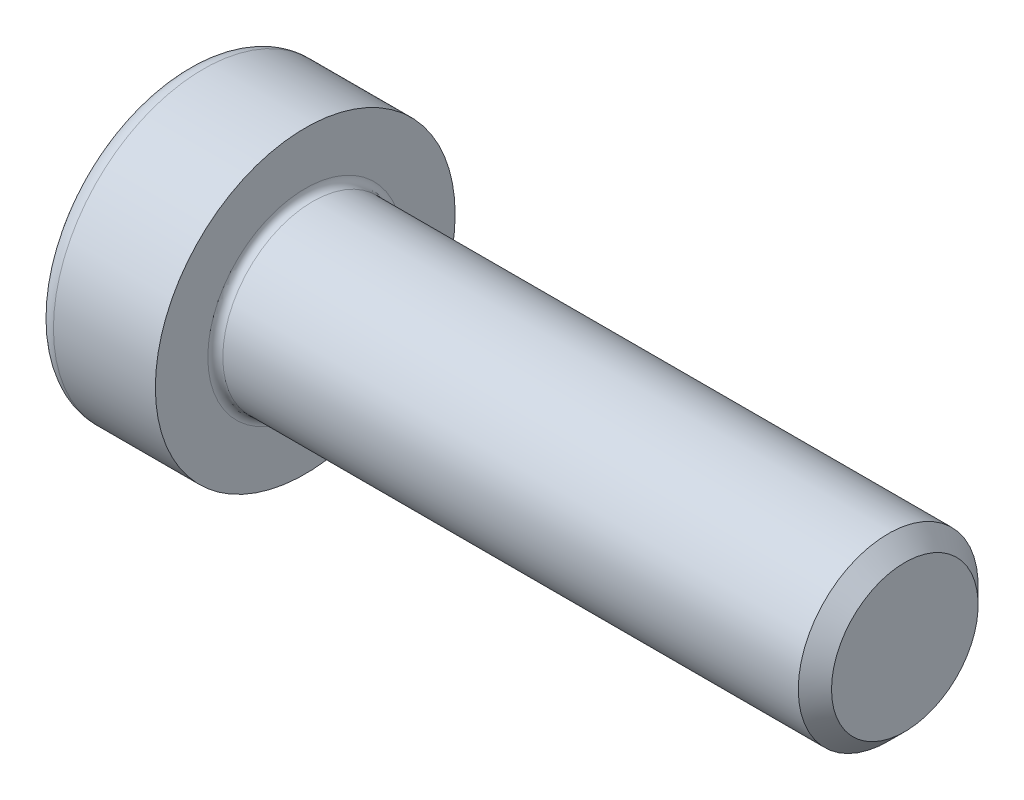
ISO-10303-21;
HEADER;
FILE_DESCRIPTION(('STEP AP214'),'2;1');
FILE_NAME('part.step','',(''),(''),'','','');
FILE_SCHEMA(('AUTOMOTIVE_DESIGN { 1 0 10303 214 1 1 1 1 }'));
ENDSEC;
DATA;
#1=APPLICATION_CONTEXT('core data for automotive mechanical design processes');
#2=APPLICATION_PROTOCOL_DEFINITION('international standard','automotive_design',2000,#1);
#3=PRODUCT_CONTEXT('',#1,'mechanical');
#4=PRODUCT('Part','Part','',(#3));
#5=PRODUCT_RELATED_PRODUCT_CATEGORY('part','',(#4));
#6=PRODUCT_DEFINITION_FORMATION('','',#4);
#7=PRODUCT_DEFINITION_CONTEXT('part definition',#1,'design');
#8=PRODUCT_DEFINITION('design','',#6,#7);
#9=PRODUCT_DEFINITION_SHAPE('','',#8);
#10=(LENGTH_UNIT() NAMED_UNIT(*) SI_UNIT(.MILLI.,.METRE.));
#11=(NAMED_UNIT(*) PLANE_ANGLE_UNIT() SI_UNIT($,.RADIAN.));
#12=(NAMED_UNIT(*) SI_UNIT($,.STERADIAN.) SOLID_ANGLE_UNIT());
#13=UNCERTAINTY_MEASURE_WITH_UNIT(LENGTH_MEASURE(1.E-05),#10,'distance_accuracy_value','');
#14=(GEOMETRIC_REPRESENTATION_CONTEXT(3) GLOBAL_UNCERTAINTY_ASSIGNED_CONTEXT((#13)) GLOBAL_UNIT_ASSIGNED_CONTEXT((#10,
#11,#12)) REPRESENTATION_CONTEXT('',''));
#15=CARTESIAN_POINT('',(0.,0.,0.));
#16=DIRECTION('',(0.,0.,1.));
#17=DIRECTION('',(1.,0.,0.));
#18=AXIS2_PLACEMENT_3D('',#15,#16,#17);
#19=CARTESIAN_POINT('',(2.5,4.33012701892219,-2.50000000000001));
#20=DIRECTION('',(1.,0.,0.));
#21=DIRECTION('',(0.,0.,-1.));
#22=AXIS2_PLACEMENT_3D('',#19,#20,#21);
#23=PLANE('',#22);
#24=DIRECTION('',(0.,-1.,0.));
#25=VECTOR('',#24,1.);
#26=CARTESIAN_POINT('',(2.5,1.44337567297407,-2.50000000000001));
#27=LINE('',#26,#25);
#28=CARTESIAN_POINT('',(2.5,1.44337567297407,-2.50000000000001));
#29=VERTEX_POINT('',#28);
#30=CARTESIAN_POINT('',(2.5,0.,-2.5));
#31=VERTEX_POINT('',#30);
#32=EDGE_CURVE('E136',#29,#31,#27,.T.);
#33=ORIENTED_EDGE('',*,*,#32,.T.);
#34=CARTESIAN_POINT('',(2.5,0.,0.));
#35=DIRECTION('',(1.,0.,0.));
#36=DIRECTION('',(0.,0.,-1.));
#37=AXIS2_PLACEMENT_3D('',#34,#35,#36);
#38=CIRCLE('',#37,2.5);
#39=CARTESIAN_POINT('',(2.5,2.1650635094611,-1.25));
#40=VERTEX_POINT('',#39);
#41=EDGE_CURVE('E11',#31,#40,#38,.T.);
#42=ORIENTED_EDGE('',*,*,#41,.T.);
#43=DIRECTION('',(0.,-0.500000000000001,-0.866025403784438));
#44=VECTOR('',#43,1.);
#45=CARTESIAN_POINT('',(2.5,2.88675134594813,0.));
#46=LINE('',#45,#44);
#47=EDGE_CURVE('E139',#40,#29,#46,.T.);
#48=ORIENTED_EDGE('',*,*,#47,.T.);
#49=EDGE_LOOP('',(#33,#42,#48));
#50=FACE_BOUND('',#49,.T.);
#51=ADVANCED_FACE('F32',(#50),#23,.F.);
#52=CARTESIAN_POINT('',(2.5,2.88675134594813,0.));
#53=VERTEX_POINT('',#52);
#54=EDGE_CURVE('E140',#53,#40,#46,.T.);
#55=ORIENTED_EDGE('',*,*,#54,.T.);
#56=CARTESIAN_POINT('',(2.5,2.1650635094611,1.24999999999999));
#57=VERTEX_POINT('',#56);
#58=EDGE_CURVE('E41',#40,#57,#38,.T.);
#59=ORIENTED_EDGE('',*,*,#58,.T.);
#60=DIRECTION('',(0.,-0.499999999999997,0.86602540378444));
#61=VECTOR('',#60,1.);
#62=CARTESIAN_POINT('',(2.5,2.88675134594813,0.));
#63=LINE('',#62,#61);
#64=EDGE_CURVE('E119',#53,#57,#63,.T.);
#65=ORIENTED_EDGE('',*,*,#64,.F.);
#66=EDGE_LOOP('',(#55,#59,#65));
#67=FACE_BOUND('',#66,.T.);
#68=ADVANCED_FACE('F209',(#67),#23,.F.);
#69=CARTESIAN_POINT('',(2.5,1.44337567297408,2.5));
#70=VERTEX_POINT('',#69);
#71=EDGE_CURVE('E123',#57,#70,#63,.T.);
#72=ORIENTED_EDGE('',*,*,#71,.F.);
#73=CARTESIAN_POINT('',(2.5,0.,0.));
#74=DIRECTION('',(-1.,0.,0.));
#75=DIRECTION('',(0.,0.,1.));
#76=AXIS2_PLACEMENT_3D('',#73,#74,#75);
#77=CIRCLE('',#76,2.5);
#78=CARTESIAN_POINT('',(2.5,0.,2.5));
#79=VERTEX_POINT('',#78);
#80=EDGE_CURVE('E115',#79,#57,#77,.T.);
#81=ORIENTED_EDGE('',*,*,#80,.F.);
#82=DIRECTION('',(0.,1.,0.));
#83=VECTOR('',#82,1.);
#84=CARTESIAN_POINT('',(2.5,-1.44337567297405,2.5));
#85=LINE('',#84,#83);
#86=EDGE_CURVE('E122',#79,#70,#85,.T.);
#87=ORIENTED_EDGE('',*,*,#86,.T.);
#88=EDGE_LOOP('',(#72,#81,#87));
#89=FACE_BOUND('',#88,.T.);
#90=ADVANCED_FACE('F214',(#89),#23,.F.);
#91=CARTESIAN_POINT('',(2.5,-1.44337567297405,2.5));
#92=VERTEX_POINT('',#91);
#93=EDGE_CURVE('E124',#92,#79,#85,.T.);
#94=ORIENTED_EDGE('',*,*,#93,.T.);
#95=CARTESIAN_POINT('',(2.5,-2.1650635094611,1.25));
#96=VERTEX_POINT('',#95);
#97=EDGE_CURVE('E198',#79,#96,#38,.T.);
#98=ORIENTED_EDGE('',*,*,#97,.T.);
#99=DIRECTION('',(0.,-0.500000000000001,-0.866025403784438));
#100=VECTOR('',#99,1.);
#101=CARTESIAN_POINT('',(2.5,-1.44337567297405,2.5));
#102=LINE('',#101,#100);
#103=EDGE_CURVE('E128',#92,#96,#102,.T.);
#104=ORIENTED_EDGE('',*,*,#103,.F.);
#105=EDGE_LOOP('',(#94,#98,#104));
#106=FACE_BOUND('',#105,.T.);
#107=ADVANCED_FACE('F253',(#106),#23,.F.);
#108=CARTESIAN_POINT('',(2.5,-2.88675134594812,0.));
#109=VERTEX_POINT('',#108);
#110=EDGE_CURVE('E127',#96,#109,#102,.T.);
#111=ORIENTED_EDGE('',*,*,#110,.F.);
#112=CARTESIAN_POINT('',(2.5,-2.1650635094611,-1.24999999999999));
#113=VERTEX_POINT('',#112);
#114=EDGE_CURVE('E192',#96,#113,#38,.T.);
#115=ORIENTED_EDGE('',*,*,#114,.T.);
#116=DIRECTION('',(0.,0.499999999999998,-0.86602540378444));
#117=VECTOR('',#116,1.);
#118=CARTESIAN_POINT('',(2.5,-2.88675134594812,0.));
#119=LINE('',#118,#117);
#120=EDGE_CURVE('E132',#109,#113,#119,.T.);
#121=ORIENTED_EDGE('',*,*,#120,.F.);
#122=EDGE_LOOP('',(#111,#115,#121));
#123=FACE_BOUND('',#122,.T.);
#124=ADVANCED_FACE('F246',(#123),#23,.F.);
#125=CARTESIAN_POINT('',(0.,0.,0.));
#126=DIRECTION('',(-1.,0.,0.));
#127=DIRECTION('',(0.,0.,1.));
#128=AXIS2_PLACEMENT_3D('',#125,#126,#127);
#129=PLANE('',#128);
#130=CARTESIAN_POINT('',(0.,0.,0.));
#131=DIRECTION('',(-1.,0.,0.));
#132=DIRECTION('',(0.,0.,1.));
#133=AXIS2_PLACEMENT_3D('',#130,#131,#132);
#134=CIRCLE('',#133,4.4);
#135=CARTESIAN_POINT('',(0.,0.,4.4));
#136=VERTEX_POINT('',#135);
#137=EDGE_CURVE('E186',#136,#136,#134,.T.);
#138=ORIENTED_EDGE('',*,*,#137,.T.);
#139=EDGE_LOOP('',(#138));
#140=FACE_BOUND('',#139,.T.);
#141=DIRECTION('',(0.,-0.500000000000001,-0.866025403784438));
#142=VECTOR('',#141,1.);
#143=CARTESIAN_POINT('',(0.,2.88675134594813,0.));
#144=LINE('',#143,#142);
#145=CARTESIAN_POINT('',(0.,2.88675134594813,0.));
#146=VERTEX_POINT('',#145);
#147=CARTESIAN_POINT('',(0.,1.44337567297407,-2.50000000000001));
#148=VERTEX_POINT('',#147);
#149=EDGE_CURVE('E155',#146,#148,#144,.T.);
#150=ORIENTED_EDGE('',*,*,#149,.F.);
#151=DIRECTION('',(0.,-0.499999999999997,0.86602540378444));
#152=VECTOR('',#151,1.);
#153=CARTESIAN_POINT('',(0.,2.88675134594813,0.));
#154=LINE('',#153,#152);
#155=CARTESIAN_POINT('',(0.,1.44337567297408,2.5));
#156=VERTEX_POINT('',#155);
#157=EDGE_CURVE('E54',#146,#156,#154,.T.);
#158=ORIENTED_EDGE('',*,*,#157,.T.);
#159=DIRECTION('',(0.,1.,0.));
#160=VECTOR('',#159,1.);
#161=CARTESIAN_POINT('',(0.,-1.44337567297405,2.5));
#162=LINE('',#161,#160);
#163=CARTESIAN_POINT('',(0.,-1.44337567297405,2.5));
#164=VERTEX_POINT('',#163);
#165=EDGE_CURVE('E145',#164,#156,#162,.T.);
#166=ORIENTED_EDGE('',*,*,#165,.F.);
#167=DIRECTION('',(0.,-0.500000000000001,-0.866025403784438));
#168=VECTOR('',#167,1.);
#169=CARTESIAN_POINT('',(0.,-1.44337567297405,2.5));
#170=LINE('',#169,#168);
#171=CARTESIAN_POINT('',(0.,-2.88675134594812,0.));
#172=VERTEX_POINT('',#171);
#173=EDGE_CURVE('E148',#164,#172,#170,.T.);
#174=ORIENTED_EDGE('',*,*,#173,.T.);
#175=DIRECTION('',(0.,0.499999999999998,-0.86602540378444));
#176=VECTOR('',#175,1.);
#177=CARTESIAN_POINT('',(0.,-2.88675134594812,0.));
#178=LINE('',#177,#176);
#179=CARTESIAN_POINT('',(0.,-1.44337567297406,-2.5));
#180=VERTEX_POINT('',#179);
#181=EDGE_CURVE('E150',#172,#180,#178,.T.);
#182=ORIENTED_EDGE('',*,*,#181,.T.);
#183=DIRECTION('',(0.,-1.,0.));
#184=VECTOR('',#183,1.);
#185=CARTESIAN_POINT('',(0.,1.44337567297407,-2.50000000000001));
#186=LINE('',#185,#184);
#187=EDGE_CURVE('E152',#148,#180,#186,.T.);
#188=ORIENTED_EDGE('',*,*,#187,.F.);
#189=EDGE_LOOP('',(#150,#158,#166,#174,#182,#188));
#190=FACE_BOUND('',#189,.T.);
#191=ADVANCED_FACE('F225',(#140,#190),#129,.T.);
#192=CARTESIAN_POINT('',(-31.75,0.,0.));
#193=DIRECTION('',(-1.,0.,0.));
#194=DIRECTION('',(0.,0.,1.));
#195=AXIS2_PLACEMENT_3D('',#192,#193,#194);
#196=CYLINDRICAL_SURFACE('',#195,5.);
#197=CARTESIAN_POINT('',(0.600000000000003,0.,0.));
#198=DIRECTION('',(-1.,0.,0.));
#199=DIRECTION('',(0.,0.,1.));
#200=AXIS2_PLACEMENT_3D('',#197,#198,#199);
#201=CIRCLE('',#200,5.);
#202=CARTESIAN_POINT('',(0.600000000000003,0.,5.));
#203=VERTEX_POINT('',#202);
#204=EDGE_CURVE('E188',#203,#203,#201,.F.);
#205=ORIENTED_EDGE('',*,*,#204,.T.);
#206=EDGE_LOOP('',(#205));
#207=FACE_BOUND('',#206,.T.);
#208=CARTESIAN_POINT('',(4.,0.,0.));
#209=DIRECTION('',(-1.,0.,0.));
#210=DIRECTION('',(0.,0.,1.));
#211=AXIS2_PLACEMENT_3D('',#208,#209,#210);
#212=CIRCLE('',#211,5.);
#213=CARTESIAN_POINT('',(4.,0.,5.));
#214=VERTEX_POINT('',#213);
#215=EDGE_CURVE('E177',#214,#214,#212,.T.);
#216=ORIENTED_EDGE('',*,*,#215,.T.);
#217=EDGE_LOOP('',(#216));
#218=FACE_BOUND('',#217,.T.);
#219=ADVANCED_FACE('F258',(#207,#218),#196,.T.);
#220=CARTESIAN_POINT('',(4.,5.,0.));
#221=DIRECTION('',(1.,0.,0.));
#222=DIRECTION('',(0.,0.,-1.));
#223=AXIS2_PLACEMENT_3D('',#220,#221,#222);
#224=PLANE('',#223);
#225=CARTESIAN_POINT('',(4.,0.,0.));
#226=DIRECTION('',(1.,0.,0.));
#227=DIRECTION('',(0.,0.,-1.));
#228=AXIS2_PLACEMENT_3D('',#225,#226,#227);
#229=CIRCLE('',#228,3.24999999999999);
#230=CARTESIAN_POINT('',(4.,0.,-3.24999999999999));
#231=VERTEX_POINT('',#230);
#232=EDGE_CURVE('E180',#231,#231,#229,.F.);
#233=ORIENTED_EDGE('',*,*,#232,.T.);
#234=EDGE_LOOP('',(#233));
#235=FACE_BOUND('',#234,.T.);
#236=ORIENTED_EDGE('',*,*,#215,.F.);
#237=EDGE_LOOP('',(#236));
#238=FACE_BOUND('',#237,.T.);
#239=ADVANCED_FACE('F289',(#235,#238),#224,.T.);
#240=CARTESIAN_POINT('',(-31.75,0.,0.));
#241=DIRECTION('',(-1.,0.,0.));
#242=DIRECTION('',(0.,0.,1.));
#243=AXIS2_PLACEMENT_3D('',#240,#241,#242);
#244=CYLINDRICAL_SURFACE('',#243,2.99999999999999);
#245=CARTESIAN_POINT('',(4.25,0.,0.));
#246=DIRECTION('',(1.,0.,0.));
#247=DIRECTION('',(0.,0.,-1.));
#248=AXIS2_PLACEMENT_3D('',#245,#246,#247);
#249=CIRCLE('',#248,2.99999999999999);
#250=CARTESIAN_POINT('',(4.25,0.,-2.99999999999999));
#251=VERTEX_POINT('',#250);
#252=EDGE_CURVE('E183',#251,#251,#249,.T.);
#253=ORIENTED_EDGE('',*,*,#252,.T.);
#254=EDGE_LOOP('',(#253));
#255=FACE_BOUND('',#254,.T.);
#256=CARTESIAN_POINT('',(23.4455,0.,0.));
#257=DIRECTION('',(-1.,0.,0.));
#258=DIRECTION('',(0.,0.,1.));
#259=AXIS2_PLACEMENT_3D('',#256,#257,#258);
#260=CIRCLE('',#259,2.99999999999999);
#261=CARTESIAN_POINT('',(23.4455,0.,2.99999999999999));
#262=VERTEX_POINT('',#261);
#263=EDGE_CURVE('E174',#262,#262,#260,.T.);
#264=ORIENTED_EDGE('',*,*,#263,.T.);
#265=EDGE_LOOP('',(#264));
#266=FACE_BOUND('',#265,.T.);
#267=ADVANCED_FACE('F285',(#255,#266),#244,.T.);
#268=CARTESIAN_POINT('',(24.,0.,0.));
#269=DIRECTION('',(-1.,0.,0.));
#270=DIRECTION('',(0.,0.,1.));
#271=AXIS2_PLACEMENT_3D('',#268,#269,#270);
#272=CONICAL_SURFACE('',#271,2.4455,0.785398163397433);
#273=ORIENTED_EDGE('',*,*,#263,.F.);
#274=EDGE_LOOP('',(#273));
#275=FACE_BOUND('',#274,.T.);
#276=CARTESIAN_POINT('',(24.,0.,0.));
#277=DIRECTION('',(-1.,0.,0.));
#278=DIRECTION('',(0.,0.,1.));
#279=AXIS2_PLACEMENT_3D('',#276,#277,#278);
#280=CIRCLE('',#279,2.4455);
#281=CARTESIAN_POINT('',(24.,0.,2.4455));
#282=VERTEX_POINT('',#281);
#283=EDGE_CURVE('E171',#282,#282,#280,.T.);
#284=ORIENTED_EDGE('',*,*,#283,.T.);
#285=EDGE_LOOP('',(#284));
#286=FACE_BOUND('',#285,.T.);
#287=ADVANCED_FACE('F281',(#275,#286),#272,.T.);
#288=CARTESIAN_POINT('',(24.,2.4455,0.));
#289=DIRECTION('',(1.,0.,0.));
#290=DIRECTION('',(0.,0.,-1.));
#291=AXIS2_PLACEMENT_3D('',#288,#289,#290);
#292=PLANE('',#291);
#293=ORIENTED_EDGE('',*,*,#283,.F.);
#294=EDGE_LOOP('',(#293));
#295=FACE_BOUND('',#294,.T.);
#296=ADVANCED_FACE('F277',(#295),#292,.T.);
#297=CARTESIAN_POINT('',(4.25,0.,0.));
#298=DIRECTION('',(1.,0.,0.));
#299=DIRECTION('',(0.,0.,-1.));
#300=AXIS2_PLACEMENT_3D('',#297,#298,#299);
#301=TOROIDAL_SURFACE('',#300,3.24999999999999,0.25);
#302=ORIENTED_EDGE('',*,*,#252,.F.);
#303=EDGE_LOOP('',(#302));
#304=FACE_BOUND('',#303,.T.);
#305=ORIENTED_EDGE('',*,*,#232,.F.);
#306=EDGE_LOOP('',(#305));
#307=FACE_BOUND('',#306,.T.);
#308=ADVANCED_FACE('F280',(#304,#307),#301,.F.);
#309=CARTESIAN_POINT('',(0.600000000000003,0.,0.));
#310=DIRECTION('',(-1.,0.,0.));
#311=DIRECTION('',(0.,0.,1.));
#312=AXIS2_PLACEMENT_3D('',#309,#310,#311);
#313=TOROIDAL_SURFACE('',#312,4.4,0.6);
#314=ORIENTED_EDGE('',*,*,#204,.F.);
#315=EDGE_LOOP('',(#314));
#316=FACE_BOUND('',#315,.T.);
#317=ORIENTED_EDGE('',*,*,#137,.F.);
#318=EDGE_LOOP('',(#317));
#319=FACE_BOUND('',#318,.T.);
#320=ADVANCED_FACE('F34',(#316,#319),#313,.T.);
#321=CARTESIAN_POINT('',(2.5,2.88675134594813,0.));
#322=DIRECTION('',(0.,-0.86602540378444,-0.499999999999997));
#323=DIRECTION('',(0.,0.499999999999997,-0.86602540378444));
#324=AXIS2_PLACEMENT_3D('',#321,#322,#323);
#325=PLANE('',#324);
#326=DIRECTION('',(-1.,0.,0.));
#327=VECTOR('',#326,1.);
#328=CARTESIAN_POINT('',(2.5,1.44337567297408,2.5));
#329=LINE('',#328,#327);
#330=EDGE_CURVE('E169',#70,#156,#329,.T.);
#331=ORIENTED_EDGE('',*,*,#330,.T.);
#332=ORIENTED_EDGE('',*,*,#157,.F.);
#333=DIRECTION('',(-1.,0.,0.));
#334=VECTOR('',#333,1.);
#335=CARTESIAN_POINT('',(2.5,2.88675134594813,0.));
#336=LINE('',#335,#334);
#337=EDGE_CURVE('E143',#53,#146,#336,.T.);
#338=ORIENTED_EDGE('',*,*,#337,.F.);
#339=ORIENTED_EDGE('',*,*,#64,.T.);
#340=ORIENTED_EDGE('',*,*,#71,.T.);
#341=EDGE_LOOP('',(#331,#332,#338,#339,#340));
#342=FACE_BOUND('',#341,.T.);
#343=ADVANCED_FACE('F217',(#342),#325,.T.);
#344=CARTESIAN_POINT('',(2.5,-1.44337567297405,2.5));
#345=DIRECTION('',(0.,0.,1.));
#346=DIRECTION('',(0.,-1.,0.));
#347=AXIS2_PLACEMENT_3D('',#344,#345,#346);
#348=PLANE('',#347);
#349=ORIENTED_EDGE('',*,*,#86,.F.);
#350=ORIENTED_EDGE('',*,*,#93,.F.);
#351=DIRECTION('',(-1.,0.,0.));
#352=VECTOR('',#351,1.);
#353=CARTESIAN_POINT('',(2.5,-1.44337567297405,2.5));
#354=LINE('',#353,#352);
#355=EDGE_CURVE('E167',#92,#164,#354,.T.);
#356=ORIENTED_EDGE('',*,*,#355,.T.);
#357=ORIENTED_EDGE('',*,*,#165,.T.);
#358=ORIENTED_EDGE('',*,*,#330,.F.);
#359=EDGE_LOOP('',(#349,#350,#356,#357,#358));
#360=FACE_BOUND('',#359,.T.);
#361=ADVANCED_FACE('F266',(#360),#348,.F.);
#362=CARTESIAN_POINT('',(2.5,-1.44337567297405,2.5));
#363=DIRECTION('',(0.,0.866025403784438,-0.500000000000001));
#364=DIRECTION('',(0.,0.500000000000001,0.866025403784438));
#365=AXIS2_PLACEMENT_3D('',#362,#363,#364);
#366=PLANE('',#365);
#367=DIRECTION('',(-1.,0.,0.));
#368=VECTOR('',#367,1.);
#369=CARTESIAN_POINT('',(2.5,-2.88675134594812,0.));
#370=LINE('',#369,#368);
#371=EDGE_CURVE('E164',#109,#172,#370,.T.);
#372=ORIENTED_EDGE('',*,*,#371,.T.);
#373=ORIENTED_EDGE('',*,*,#173,.F.);
#374=ORIENTED_EDGE('',*,*,#355,.F.);
#375=ORIENTED_EDGE('',*,*,#103,.T.);
#376=ORIENTED_EDGE('',*,*,#110,.T.);
#377=EDGE_LOOP('',(#372,#373,#374,#375,#376));
#378=FACE_BOUND('',#377,.T.);
#379=ADVANCED_FACE('F262',(#378),#366,.T.);
#380=CARTESIAN_POINT('',(2.5,-2.88675134594812,0.));
#381=DIRECTION('',(0.,0.86602540378444,0.499999999999998));
#382=DIRECTION('',(0.,-0.499999999999998,0.86602540378444));
#383=AXIS2_PLACEMENT_3D('',#380,#381,#382);
#384=PLANE('',#383);
#385=DIRECTION('',(-1.,0.,0.));
#386=VECTOR('',#385,1.);
#387=CARTESIAN_POINT('',(2.5,-1.44337567297406,-2.5));
#388=LINE('',#387,#386);
#389=CARTESIAN_POINT('',(2.5,-1.44337567297406,-2.5));
#390=VERTEX_POINT('',#389);
#391=EDGE_CURVE('E161',#390,#180,#388,.T.);
#392=ORIENTED_EDGE('',*,*,#391,.T.);
#393=ORIENTED_EDGE('',*,*,#181,.F.);
#394=ORIENTED_EDGE('',*,*,#371,.F.);
#395=ORIENTED_EDGE('',*,*,#120,.T.);
#396=EDGE_CURVE('E131',#113,#390,#119,.T.);
#397=ORIENTED_EDGE('',*,*,#396,.T.);
#398=EDGE_LOOP('',(#392,#393,#394,#395,#397));
#399=FACE_BOUND('',#398,.T.);
#400=ADVANCED_FACE('F233',(#399),#384,.T.);
#401=CARTESIAN_POINT('',(2.5,1.44337567297407,-2.50000000000001));
#402=DIRECTION('',(0.,0.,-1.));
#403=DIRECTION('',(0.,1.,0.));
#404=AXIS2_PLACEMENT_3D('',#401,#402,#403);
#405=PLANE('',#404);
#406=EDGE_CURVE('E135',#31,#390,#27,.T.);
#407=ORIENTED_EDGE('',*,*,#406,.F.);
#408=ORIENTED_EDGE('',*,*,#32,.F.);
#409=DIRECTION('',(-1.,0.,0.));
#410=VECTOR('',#409,1.);
#411=CARTESIAN_POINT('',(2.5,1.44337567297407,-2.50000000000001));
#412=LINE('',#411,#410);
#413=EDGE_CURVE('E158',#29,#148,#412,.T.);
#414=ORIENTED_EDGE('',*,*,#413,.T.);
#415=ORIENTED_EDGE('',*,*,#187,.T.);
#416=ORIENTED_EDGE('',*,*,#391,.F.);
#417=EDGE_LOOP('',(#407,#408,#414,#415,#416));
#418=FACE_BOUND('',#417,.T.);
#419=ADVANCED_FACE('F230',(#418),#405,.F.);
#420=CARTESIAN_POINT('',(2.5,2.88675134594813,0.));
#421=DIRECTION('',(0.,0.866025403784438,-0.500000000000001));
#422=DIRECTION('',(0.,0.500000000000001,0.866025403784438));
#423=AXIS2_PLACEMENT_3D('',#420,#421,#422);
#424=PLANE('',#423);
#425=ORIENTED_EDGE('',*,*,#47,.F.);
#426=ORIENTED_EDGE('',*,*,#54,.F.);
#427=ORIENTED_EDGE('',*,*,#337,.T.);
#428=ORIENTED_EDGE('',*,*,#149,.T.);
#429=ORIENTED_EDGE('',*,*,#413,.F.);
#430=EDGE_LOOP('',(#425,#426,#427,#428,#429));
#431=FACE_BOUND('',#430,.T.);
#432=ADVANCED_FACE('F221',(#431),#424,.F.);
#433=ORIENTED_EDGE('',*,*,#396,.F.);
#434=EDGE_CURVE('E36',#113,#31,#38,.T.);
#435=ORIENTED_EDGE('',*,*,#434,.T.);
#436=ORIENTED_EDGE('',*,*,#406,.T.);
#437=EDGE_LOOP('',(#433,#435,#436));
#438=FACE_BOUND('',#437,.T.);
#439=ADVANCED_FACE('F235',(#438),#23,.F.);
#440=CARTESIAN_POINT('',(2.5,0.,0.));
#441=DIRECTION('',(-1.,0.,0.));
#442=DIRECTION('',(0.,0.,1.));
#443=AXIS2_PLACEMENT_3D('',#440,#441,#442);
#444=CONICAL_SURFACE('',#443,2.5,1.04719755119659);
#445=CARTESIAN_POINT('',(3.07735026918963,0.,0.));
#446=DIRECTION('',(-1.,0.,0.));
#447=DIRECTION('',(0.,0.,1.));
#448=AXIS2_PLACEMENT_3D('',#445,#446,#447);
#449=CIRCLE('',#448,1.5);
#450=CARTESIAN_POINT('',(3.07735026918963,0.,1.5));
#451=VERTEX_POINT('',#450);
#452=EDGE_CURVE('E112',#451,#451,#449,.T.);
#453=ORIENTED_EDGE('',*,*,#452,.F.);
#454=EDGE_LOOP('',(#453));
#455=FACE_BOUND('',#454,.T.);
#456=ORIENTED_EDGE('',*,*,#80,.T.);
#457=ORIENTED_EDGE('',*,*,#58,.F.);
#458=ORIENTED_EDGE('',*,*,#41,.F.);
#459=ORIENTED_EDGE('',*,*,#434,.F.);
#460=ORIENTED_EDGE('',*,*,#114,.F.);
#461=ORIENTED_EDGE('',*,*,#97,.F.);
#462=EDGE_LOOP('',(#456,#457,#458,#459,#460,#461));
#463=FACE_BOUND('',#462,.T.);
#464=ADVANCED_FACE('F245',(#455,#463),#444,.F.);
#465=CARTESIAN_POINT('',(0.,0.,0.));
#466=DIRECTION('',(-1.,0.,0.));
#467=DIRECTION('',(0.,0.,1.));
#468=AXIS2_PLACEMENT_3D('',#465,#466,#467);
#469=CYLINDRICAL_SURFACE('',#468,1.5);
#470=CARTESIAN_POINT('',(5.,0.,0.));
#471=DIRECTION('',(-1.,0.,0.));
#472=DIRECTION('',(0.,0.,1.));
#473=AXIS2_PLACEMENT_3D('',#470,#471,#472);
#474=CIRCLE('',#473,1.5);
#475=CARTESIAN_POINT('',(5.,0.,1.5));
#476=VERTEX_POINT('',#475);
#477=EDGE_CURVE('E110',#476,#476,#474,.T.);
#478=ORIENTED_EDGE('',*,*,#477,.F.);
#479=EDGE_LOOP('',(#478));
#480=FACE_BOUND('',#479,.T.);
#481=ORIENTED_EDGE('',*,*,#452,.T.);
#482=EDGE_LOOP('',(#481));
#483=FACE_BOUND('',#482,.T.);
#484=ADVANCED_FACE('F106',(#480,#483),#469,.F.);
#485=CARTESIAN_POINT('',(5.,0.,0.));
#486=DIRECTION('',(-1.,0.,0.));
#487=DIRECTION('',(0.,0.,1.));
#488=AXIS2_PLACEMENT_3D('',#485,#486,#487);
#489=CONICAL_SURFACE('',#488,1.5,1.04719755119659);
#490=CARTESIAN_POINT('',(5.86602540378445,0.,0.));
#491=VERTEX_POINT('',#490);
#492=VERTEX_LOOP('',#491);
#493=FACE_BOUND('',#492,.T.);
#494=ORIENTED_EDGE('',*,*,#477,.T.);
#495=EDGE_LOOP('',(#494));
#496=FACE_BOUND('',#495,.T.);
#497=ADVANCED_FACE('F103',(#493,#496),#489,.F.);
#498=CLOSED_SHELL('',(#51,#68,#90,#107,#124,#191,#219,#239,#267,#287,#296,#308,#320,#343,#361,
#379,#400,#419,#432,#439,#464,#484,#497));
#499=MANIFOLD_SOLID_BREP('B2',#498);
#500=ADVANCED_BREP_SHAPE_REPRESENTATION('',(#18,#499),#14);
#501=SHAPE_DEFINITION_REPRESENTATION(#9,#500);
ENDSEC;
END-ISO-10303-21;
